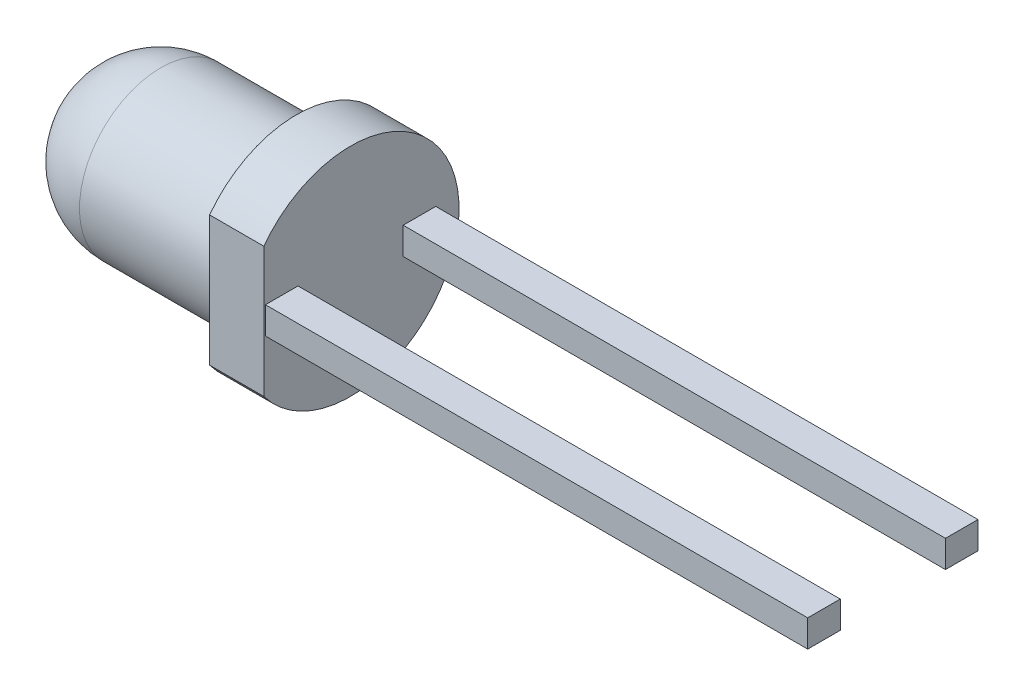
ISO-10303-21;
HEADER;
FILE_DESCRIPTION(('STEP AP214'),'2;1');
FILE_NAME('part.step','',(''),(''),'','','');
FILE_SCHEMA(('AUTOMOTIVE_DESIGN { 1 0 10303 214 1 1 1 1 }'));
ENDSEC;
DATA;
#1=APPLICATION_CONTEXT('core data for automotive mechanical design processes');
#2=APPLICATION_PROTOCOL_DEFINITION('international standard','automotive_design',2000,#1);
#3=PRODUCT_CONTEXT('',#1,'mechanical');
#4=PRODUCT('Part','Part','',(#3));
#5=PRODUCT_RELATED_PRODUCT_CATEGORY('part','',(#4));
#6=PRODUCT_DEFINITION_FORMATION('','',#4);
#7=PRODUCT_DEFINITION_CONTEXT('part definition',#1,'design');
#8=PRODUCT_DEFINITION('design','',#6,#7);
#9=PRODUCT_DEFINITION_SHAPE('','',#8);
#10=(LENGTH_UNIT() NAMED_UNIT(*) SI_UNIT(.MILLI.,.METRE.));
#11=(NAMED_UNIT(*) PLANE_ANGLE_UNIT() SI_UNIT($,.RADIAN.));
#12=(NAMED_UNIT(*) SI_UNIT($,.STERADIAN.) SOLID_ANGLE_UNIT());
#13=UNCERTAINTY_MEASURE_WITH_UNIT(LENGTH_MEASURE(1.E-05),#10,'distance_accuracy_value','');
#14=(GEOMETRIC_REPRESENTATION_CONTEXT(3) GLOBAL_UNCERTAINTY_ASSIGNED_CONTEXT((#13)) GLOBAL_UNIT_ASSIGNED_CONTEXT((#10,
#11,#12)) REPRESENTATION_CONTEXT('',''));
#15=CARTESIAN_POINT('',(0.,0.,0.));
#16=DIRECTION('',(0.,0.,1.));
#17=DIRECTION('',(1.,0.,0.));
#18=AXIS2_PLACEMENT_3D('',#15,#16,#17);
#19=CARTESIAN_POINT('',(10.,0.250000000000001,-1.57));
#20=DIRECTION('',(0.,0.,1.));
#21=DIRECTION('',(1.,0.,0.));
#22=AXIS2_PLACEMENT_3D('',#19,#20,#21);
#23=PLANE('',#22);
#24=DIRECTION('',(0.,1.,0.));
#25=VECTOR('',#24,1.);
#26=CARTESIAN_POINT('',(0.,0.250000000000001,-1.57));
#27=LINE('',#26,#25);
#28=CARTESIAN_POINT('',(0.,-0.249999999999999,-1.57));
#29=VERTEX_POINT('',#28);
#30=CARTESIAN_POINT('',(0.,0.250000000000001,-1.57));
#31=VERTEX_POINT('',#30);
#32=EDGE_CURVE('E109',#29,#31,#27,.T.);
#33=ORIENTED_EDGE('',*,*,#32,.T.);
#34=DIRECTION('',(-1.,0.,0.));
#35=VECTOR('',#34,1.);
#36=CARTESIAN_POINT('',(10.,0.250000000000001,-1.57));
#37=LINE('',#36,#35);
#38=CARTESIAN_POINT('',(10.,0.250000000000001,-1.57));
#39=VERTEX_POINT('',#38);
#40=EDGE_CURVE('E12',#39,#31,#37,.T.);
#41=ORIENTED_EDGE('',*,*,#40,.F.);
#42=DIRECTION('',(0.,1.,0.));
#43=VECTOR('',#42,1.);
#44=CARTESIAN_POINT('',(10.,0.250000000000001,-1.57));
#45=LINE('',#44,#43);
#46=CARTESIAN_POINT('',(10.,-0.249999999999999,-1.57));
#47=VERTEX_POINT('',#46);
#48=EDGE_CURVE('E97',#47,#39,#45,.T.);
#49=ORIENTED_EDGE('',*,*,#48,.F.);
#50=DIRECTION('',(-1.,0.,0.));
#51=VECTOR('',#50,1.);
#52=CARTESIAN_POINT('',(10.,-0.249999999999999,-1.57));
#53=LINE('',#52,#51);
#54=EDGE_CURVE('E105',#47,#29,#53,.T.);
#55=ORIENTED_EDGE('',*,*,#54,.T.);
#56=EDGE_LOOP('',(#33,#41,#49,#55));
#57=FACE_BOUND('',#56,.T.);
#58=ADVANCED_FACE('F46',(#57),#23,.F.);
#59=CARTESIAN_POINT('',(10.,0.250000000000001,-0.97));
#60=DIRECTION('',(0.,-1.,0.));
#61=DIRECTION('',(0.,0.,-1.));
#62=AXIS2_PLACEMENT_3D('',#59,#60,#61);
#63=PLANE('',#62);
#64=DIRECTION('',(0.,0.,1.));
#65=VECTOR('',#64,1.);
#66=CARTESIAN_POINT('',(0.,0.250000000000001,-0.97));
#67=LINE('',#66,#65);
#68=CARTESIAN_POINT('',(0.,0.250000000000001,-0.97));
#69=VERTEX_POINT('',#68);
#70=EDGE_CURVE('E101',#31,#69,#67,.T.);
#71=ORIENTED_EDGE('',*,*,#70,.T.);
#72=DIRECTION('',(-1.,0.,0.));
#73=VECTOR('',#72,1.);
#74=CARTESIAN_POINT('',(10.,0.250000000000001,-0.97));
#75=LINE('',#74,#73);
#76=CARTESIAN_POINT('',(10.,0.250000000000001,-0.97));
#77=VERTEX_POINT('',#76);
#78=EDGE_CURVE('E54',#77,#69,#75,.T.);
#79=ORIENTED_EDGE('',*,*,#78,.F.);
#80=DIRECTION('',(0.,0.,1.));
#81=VECTOR('',#80,1.);
#82=CARTESIAN_POINT('',(10.,0.250000000000001,-0.97));
#83=LINE('',#82,#81);
#84=EDGE_CURVE('E92',#39,#77,#83,.T.);
#85=ORIENTED_EDGE('',*,*,#84,.F.);
#86=ORIENTED_EDGE('',*,*,#40,.T.);
#87=EDGE_LOOP('',(#71,#79,#85,#86));
#88=FACE_BOUND('',#87,.T.);
#89=ADVANCED_FACE('F100',(#88),#63,.F.);
#90=CARTESIAN_POINT('',(10.,0.250000000000001,-0.97));
#91=DIRECTION('',(0.,0.,-1.));
#92=DIRECTION('',(0.,1.,0.));
#93=AXIS2_PLACEMENT_3D('',#90,#91,#92);
#94=PLANE('',#93);
#95=DIRECTION('',(0.,-1.,0.));
#96=VECTOR('',#95,1.);
#97=CARTESIAN_POINT('',(0.,0.250000000000001,-0.97));
#98=LINE('',#97,#96);
#99=CARTESIAN_POINT('',(0.,-0.249999999999999,-0.97));
#100=VERTEX_POINT('',#99);
#101=EDGE_CURVE('E79',#69,#100,#98,.T.);
#102=ORIENTED_EDGE('',*,*,#101,.T.);
#103=DIRECTION('',(-1.,0.,0.));
#104=VECTOR('',#103,1.);
#105=CARTESIAN_POINT('',(10.,-0.249999999999999,-0.97));
#106=LINE('',#105,#104);
#107=CARTESIAN_POINT('',(10.,-0.249999999999999,-0.97));
#108=VERTEX_POINT('',#107);
#109=EDGE_CURVE('E102',#108,#100,#106,.T.);
#110=ORIENTED_EDGE('',*,*,#109,.F.);
#111=DIRECTION('',(0.,-1.,0.));
#112=VECTOR('',#111,1.);
#113=CARTESIAN_POINT('',(10.,0.250000000000001,-0.97));
#114=LINE('',#113,#112);
#115=EDGE_CURVE('E95',#77,#108,#114,.T.);
#116=ORIENTED_EDGE('',*,*,#115,.F.);
#117=ORIENTED_EDGE('',*,*,#78,.T.);
#118=EDGE_LOOP('',(#102,#110,#116,#117));
#119=FACE_BOUND('',#118,.T.);
#120=ADVANCED_FACE('F103',(#119),#94,.F.);
#121=CARTESIAN_POINT('',(10.,-0.249999999999999,-0.97));
#122=DIRECTION('',(0.,1.,0.));
#123=DIRECTION('',(0.,0.,1.));
#124=AXIS2_PLACEMENT_3D('',#121,#122,#123);
#125=PLANE('',#124);
#126=DIRECTION('',(0.,0.,-1.));
#127=VECTOR('',#126,1.);
#128=CARTESIAN_POINT('',(0.,-0.249999999999999,-0.97));
#129=LINE('',#128,#127);
#130=EDGE_CURVE('E85',#100,#29,#129,.T.);
#131=ORIENTED_EDGE('',*,*,#130,.T.);
#132=ORIENTED_EDGE('',*,*,#54,.F.);
#133=DIRECTION('',(0.,0.,-1.));
#134=VECTOR('',#133,1.);
#135=CARTESIAN_POINT('',(10.,-0.249999999999999,-0.97));
#136=LINE('',#135,#134);
#137=EDGE_CURVE('E62',#108,#47,#136,.T.);
#138=ORIENTED_EDGE('',*,*,#137,.F.);
#139=ORIENTED_EDGE('',*,*,#109,.T.);
#140=EDGE_LOOP('',(#131,#132,#138,#139));
#141=FACE_BOUND('',#140,.T.);
#142=ADVANCED_FACE('F116',(#141),#125,.F.);
#143=CARTESIAN_POINT('',(10.,-0.249999999999999,-1.57));
#144=DIRECTION('',(1.,0.,0.));
#145=DIRECTION('',(0.,0.,-1.));
#146=AXIS2_PLACEMENT_3D('',#143,#144,#145);
#147=PLANE('',#146);
#148=ORIENTED_EDGE('',*,*,#48,.T.);
#149=ORIENTED_EDGE('',*,*,#84,.T.);
#150=ORIENTED_EDGE('',*,*,#115,.T.);
#151=ORIENTED_EDGE('',*,*,#137,.T.);
#152=EDGE_LOOP('',(#148,#149,#150,#151));
#153=FACE_BOUND('',#152,.T.);
#154=ADVANCED_FACE('F93',(#153),#147,.T.);
#155=CARTESIAN_POINT('',(0.,-0.249999999999999,-1.57));
#156=DIRECTION('',(1.,0.,0.));
#157=DIRECTION('',(0.,0.,-1.));
#158=AXIS2_PLACEMENT_3D('',#155,#156,#157);
#159=PLANE('',#158);
#160=ORIENTED_EDGE('',*,*,#32,.F.);
#161=ORIENTED_EDGE('',*,*,#130,.F.);
#162=ORIENTED_EDGE('',*,*,#101,.F.);
#163=ORIENTED_EDGE('',*,*,#70,.F.);
#164=EDGE_LOOP('',(#160,#161,#162,#163));
#165=FACE_BOUND('',#164,.T.);
#166=ADVANCED_FACE('F119',(#165),#159,.F.);
#167=CLOSED_SHELL('',(#58,#89,#120,#142,#154,#166));
#168=MANIFOLD_SOLID_BREP('B2',#167);
#169=CARTESIAN_POINT('',(10.,0.25,0.97));
#170=DIRECTION('',(0.,0.,1.));
#171=DIRECTION('',(0.,-1.,0.));
#172=AXIS2_PLACEMENT_3D('',#169,#170,#171);
#173=PLANE('',#172);
#174=DIRECTION('',(0.,1.,0.));
#175=VECTOR('',#174,1.);
#176=CARTESIAN_POINT('',(0.,0.25,0.97));
#177=LINE('',#176,#175);
#178=CARTESIAN_POINT('',(0.,-0.25,0.97));
#179=VERTEX_POINT('',#178);
#180=CARTESIAN_POINT('',(0.,0.25,0.97));
#181=VERTEX_POINT('',#180);
#182=EDGE_CURVE('E242',#179,#181,#177,.T.);
#183=ORIENTED_EDGE('',*,*,#182,.T.);
#184=DIRECTION('',(-1.,0.,0.));
#185=VECTOR('',#184,1.);
#186=CARTESIAN_POINT('',(10.,0.25,0.97));
#187=LINE('',#186,#185);
#188=CARTESIAN_POINT('',(10.,0.25,0.97));
#189=VERTEX_POINT('',#188);
#190=EDGE_CURVE('E44',#189,#181,#187,.T.);
#191=ORIENTED_EDGE('',*,*,#190,.F.);
#192=DIRECTION('',(0.,1.,0.));
#193=VECTOR('',#192,1.);
#194=CARTESIAN_POINT('',(10.,0.25,0.97));
#195=LINE('',#194,#193);
#196=CARTESIAN_POINT('',(10.,-0.25,0.97));
#197=VERTEX_POINT('',#196);
#198=EDGE_CURVE('E230',#197,#189,#195,.T.);
#199=ORIENTED_EDGE('',*,*,#198,.F.);
#200=DIRECTION('',(-1.,0.,0.));
#201=VECTOR('',#200,1.);
#202=CARTESIAN_POINT('',(10.,-0.25,0.97));
#203=LINE('',#202,#201);
#204=EDGE_CURVE('E238',#197,#179,#203,.T.);
#205=ORIENTED_EDGE('',*,*,#204,.T.);
#206=EDGE_LOOP('',(#183,#191,#199,#205));
#207=FACE_BOUND('',#206,.T.);
#208=ADVANCED_FACE('F179',(#207),#173,.F.);
#209=CARTESIAN_POINT('',(10.,0.25,1.57));
#210=DIRECTION('',(0.,-1.,0.));
#211=DIRECTION('',(0.,0.,-1.));
#212=AXIS2_PLACEMENT_3D('',#209,#210,#211);
#213=PLANE('',#212);
#214=DIRECTION('',(0.,0.,1.));
#215=VECTOR('',#214,1.);
#216=CARTESIAN_POINT('',(0.,0.25,1.57));
#217=LINE('',#216,#215);
#218=CARTESIAN_POINT('',(0.,0.25,1.57));
#219=VERTEX_POINT('',#218);
#220=EDGE_CURVE('E234',#181,#219,#217,.T.);
#221=ORIENTED_EDGE('',*,*,#220,.T.);
#222=DIRECTION('',(-1.,0.,0.));
#223=VECTOR('',#222,1.);
#224=CARTESIAN_POINT('',(10.,0.25,1.57));
#225=LINE('',#224,#223);
#226=CARTESIAN_POINT('',(10.,0.25,1.57));
#227=VERTEX_POINT('',#226);
#228=EDGE_CURVE('E187',#227,#219,#225,.T.);
#229=ORIENTED_EDGE('',*,*,#228,.F.);
#230=DIRECTION('',(0.,0.,1.));
#231=VECTOR('',#230,1.);
#232=CARTESIAN_POINT('',(10.,0.25,1.57));
#233=LINE('',#232,#231);
#234=EDGE_CURVE('E225',#189,#227,#233,.T.);
#235=ORIENTED_EDGE('',*,*,#234,.F.);
#236=ORIENTED_EDGE('',*,*,#190,.T.);
#237=EDGE_LOOP('',(#221,#229,#235,#236));
#238=FACE_BOUND('',#237,.T.);
#239=ADVANCED_FACE('F233',(#238),#213,.F.);
#240=CARTESIAN_POINT('',(10.,0.25,1.57));
#241=DIRECTION('',(0.,0.,-1.));
#242=DIRECTION('',(-1.,0.,0.));
#243=AXIS2_PLACEMENT_3D('',#240,#241,#242);
#244=PLANE('',#243);
#245=DIRECTION('',(0.,-1.,0.));
#246=VECTOR('',#245,1.);
#247=CARTESIAN_POINT('',(0.,0.25,1.57));
#248=LINE('',#247,#246);
#249=CARTESIAN_POINT('',(0.,-0.25,1.57));
#250=VERTEX_POINT('',#249);
#251=EDGE_CURVE('E212',#219,#250,#248,.T.);
#252=ORIENTED_EDGE('',*,*,#251,.T.);
#253=DIRECTION('',(-1.,0.,0.));
#254=VECTOR('',#253,1.);
#255=CARTESIAN_POINT('',(10.,-0.25,1.57));
#256=LINE('',#255,#254);
#257=CARTESIAN_POINT('',(10.,-0.25,1.57));
#258=VERTEX_POINT('',#257);
#259=EDGE_CURVE('E235',#258,#250,#256,.T.);
#260=ORIENTED_EDGE('',*,*,#259,.F.);
#261=DIRECTION('',(0.,-1.,0.));
#262=VECTOR('',#261,1.);
#263=CARTESIAN_POINT('',(10.,0.25,1.57));
#264=LINE('',#263,#262);
#265=EDGE_CURVE('E228',#227,#258,#264,.T.);
#266=ORIENTED_EDGE('',*,*,#265,.F.);
#267=ORIENTED_EDGE('',*,*,#228,.T.);
#268=EDGE_LOOP('',(#252,#260,#266,#267));
#269=FACE_BOUND('',#268,.T.);
#270=ADVANCED_FACE('F236',(#269),#244,.F.);
#271=CARTESIAN_POINT('',(10.,-0.25,1.57));
#272=DIRECTION('',(0.,1.,0.));
#273=DIRECTION('',(0.,0.,1.));
#274=AXIS2_PLACEMENT_3D('',#271,#272,#273);
#275=PLANE('',#274);
#276=DIRECTION('',(0.,0.,-1.));
#277=VECTOR('',#276,1.);
#278=CARTESIAN_POINT('',(0.,-0.25,1.57));
#279=LINE('',#278,#277);
#280=EDGE_CURVE('E218',#250,#179,#279,.T.);
#281=ORIENTED_EDGE('',*,*,#280,.T.);
#282=ORIENTED_EDGE('',*,*,#204,.F.);
#283=DIRECTION('',(0.,0.,-1.));
#284=VECTOR('',#283,1.);
#285=CARTESIAN_POINT('',(10.,-0.25,1.57));
#286=LINE('',#285,#284);
#287=EDGE_CURVE('E195',#258,#197,#286,.T.);
#288=ORIENTED_EDGE('',*,*,#287,.F.);
#289=ORIENTED_EDGE('',*,*,#259,.T.);
#290=EDGE_LOOP('',(#281,#282,#288,#289));
#291=FACE_BOUND('',#290,.T.);
#292=ADVANCED_FACE('F249',(#291),#275,.F.);
#293=CARTESIAN_POINT('',(10.,-0.25,0.97));
#294=DIRECTION('',(1.,0.,0.));
#295=DIRECTION('',(0.,0.,-1.));
#296=AXIS2_PLACEMENT_3D('',#293,#294,#295);
#297=PLANE('',#296);
#298=ORIENTED_EDGE('',*,*,#198,.T.);
#299=ORIENTED_EDGE('',*,*,#234,.T.);
#300=ORIENTED_EDGE('',*,*,#265,.T.);
#301=ORIENTED_EDGE('',*,*,#287,.T.);
#302=EDGE_LOOP('',(#298,#299,#300,#301));
#303=FACE_BOUND('',#302,.T.);
#304=ADVANCED_FACE('F226',(#303),#297,.T.);
#305=CARTESIAN_POINT('',(0.,-0.25,0.97));
#306=DIRECTION('',(1.,0.,0.));
#307=DIRECTION('',(0.,0.,-1.));
#308=AXIS2_PLACEMENT_3D('',#305,#306,#307);
#309=PLANE('',#308);
#310=ORIENTED_EDGE('',*,*,#182,.F.);
#311=ORIENTED_EDGE('',*,*,#280,.F.);
#312=ORIENTED_EDGE('',*,*,#251,.F.);
#313=ORIENTED_EDGE('',*,*,#220,.F.);
#314=EDGE_LOOP('',(#310,#311,#312,#313));
#315=FACE_BOUND('',#314,.T.);
#316=ADVANCED_FACE('F252',(#315),#309,.F.);
#317=CLOSED_SHELL('',(#208,#239,#270,#292,#304,#316));
#318=MANIFOLD_SOLID_BREP('B6',#317);
#319=CARTESIAN_POINT('',(0.,0.,0.));
#320=DIRECTION('',(1.,0.,0.));
#321=DIRECTION('',(0.,0.,-1.));
#322=AXIS2_PLACEMENT_3D('',#319,#320,#321);
#323=PLANE('',#322);
#324=DIRECTION('',(0.,1.,0.));
#325=VECTOR('',#324,1.);
#326=CARTESIAN_POINT('',(0.,0.,1.6));
#327=LINE('',#326,#325);
#328=CARTESIAN_POINT('',(0.,-1.2,1.6));
#329=VERTEX_POINT('',#328);
#330=CARTESIAN_POINT('',(0.,1.2,1.6));
#331=VERTEX_POINT('',#330);
#332=EDGE_CURVE('E322',#329,#331,#327,.T.);
#333=ORIENTED_EDGE('',*,*,#332,.F.);
#334=CARTESIAN_POINT('',(0.,0.,0.));
#335=DIRECTION('',(1.,0.,0.));
#336=DIRECTION('',(0.,0.,-1.));
#337=AXIS2_PLACEMENT_3D('',#334,#335,#336);
#338=CIRCLE('',#337,2.);
#339=EDGE_CURVE('E177',#329,#331,#338,.T.);
#340=ORIENTED_EDGE('',*,*,#339,.T.);
#341=EDGE_LOOP('',(#333,#340));
#342=FACE_BOUND('',#341,.T.);
#343=ADVANCED_FACE('F303',(#342),#323,.T.);
#344=CARTESIAN_POINT('',(0.,0.,0.));
#345=DIRECTION('',(1.,0.,0.));
#346=DIRECTION('',(0.,0.,-1.));
#347=AXIS2_PLACEMENT_3D('',#344,#345,#346);
#348=CYLINDRICAL_SURFACE('',#347,2.);
#349=DIRECTION('',(-1.,0.,0.));
#350=VECTOR('',#349,1.);
#351=CARTESIAN_POINT('',(10.,1.2,1.6));
#352=LINE('',#351,#350);
#353=CARTESIAN_POINT('',(-1.,1.2,1.6));
#354=VERTEX_POINT('',#353);
#355=EDGE_CURVE('E317',#331,#354,#352,.T.);
#356=ORIENTED_EDGE('',*,*,#355,.F.);
#357=ORIENTED_EDGE('',*,*,#339,.F.);
#358=DIRECTION('',(-1.,0.,0.));
#359=VECTOR('',#358,1.);
#360=CARTESIAN_POINT('',(10.,-1.2,1.6));
#361=LINE('',#360,#359);
#362=CARTESIAN_POINT('',(-1.,-1.2,1.6));
#363=VERTEX_POINT('',#362);
#364=EDGE_CURVE('E329',#329,#363,#361,.T.);
#365=ORIENTED_EDGE('',*,*,#364,.T.);
#366=CARTESIAN_POINT('',(-1.,0.,0.));
#367=DIRECTION('',(1.,0.,0.));
#368=DIRECTION('',(0.,0.,-1.));
#369=AXIS2_PLACEMENT_3D('',#366,#367,#368);
#370=CIRCLE('',#369,2.);
#371=EDGE_CURVE('E310',#363,#354,#370,.T.);
#372=ORIENTED_EDGE('',*,*,#371,.T.);
#373=EDGE_LOOP('',(#356,#357,#365,#372));
#374=FACE_BOUND('',#373,.T.);
#375=ADVANCED_FACE('F336',(#374),#348,.T.);
#376=CARTESIAN_POINT('',(-1.,2.,0.));
#377=DIRECTION('',(-1.,0.,0.));
#378=DIRECTION('',(0.,0.,1.));
#379=AXIS2_PLACEMENT_3D('',#376,#377,#378);
#380=PLANE('',#379);
#381=DIRECTION('',(0.,-1.,0.));
#382=VECTOR('',#381,1.);
#383=CARTESIAN_POINT('',(-1.,1.2,1.6));
#384=LINE('',#383,#382);
#385=EDGE_CURVE('E326',#354,#363,#384,.T.);
#386=ORIENTED_EDGE('',*,*,#385,.F.);
#387=ORIENTED_EDGE('',*,*,#371,.F.);
#388=EDGE_LOOP('',(#386,#387));
#389=FACE_BOUND('',#388,.T.);
#390=CARTESIAN_POINT('',(-1.,0.,0.));
#391=DIRECTION('',(1.,0.,0.));
#392=DIRECTION('',(0.,0.,-1.));
#393=AXIS2_PLACEMENT_3D('',#390,#391,#392);
#394=CIRCLE('',#393,1.5);
#395=CARTESIAN_POINT('',(-1.,0.,-1.5));
#396=VERTEX_POINT('',#395);
#397=EDGE_CURVE('E340',#396,#396,#394,.T.);
#398=ORIENTED_EDGE('',*,*,#397,.T.);
#399=EDGE_LOOP('',(#398));
#400=FACE_BOUND('',#399,.T.);
#401=ADVANCED_FACE('F338',(#389,#400),#380,.T.);
#402=CARTESIAN_POINT('',(0.,0.,0.));
#403=DIRECTION('',(1.,0.,0.));
#404=DIRECTION('',(0.,0.,-1.));
#405=AXIS2_PLACEMENT_3D('',#402,#403,#404);
#406=CYLINDRICAL_SURFACE('',#405,1.5);
#407=CARTESIAN_POINT('',(-3.50000000000001,0.,0.));
#408=DIRECTION('',(1.,0.,0.));
#409=DIRECTION('',(0.,0.,-1.));
#410=AXIS2_PLACEMENT_3D('',#407,#408,#409);
#411=CIRCLE('',#410,1.5);
#412=CARTESIAN_POINT('',(-3.50000000000001,0.,-1.5));
#413=VERTEX_POINT('',#412);
#414=EDGE_CURVE('E342',#413,#413,#411,.T.);
#415=ORIENTED_EDGE('',*,*,#414,.T.);
#416=EDGE_LOOP('',(#415));
#417=FACE_BOUND('',#416,.T.);
#418=ORIENTED_EDGE('',*,*,#397,.F.);
#419=EDGE_LOOP('',(#418));
#420=FACE_BOUND('',#419,.T.);
#421=ADVANCED_FACE('F350',(#417,#420),#406,.T.);
#422=CARTESIAN_POINT('',(-3.50000000000001,0.,0.));
#423=DIRECTION('',(1.,0.,0.));
#424=DIRECTION('',(0.,1.,0.));
#425=AXIS2_PLACEMENT_3D('',#422,#423,#424);
#426=SPHERICAL_SURFACE('',#425,1.5);
#427=ORIENTED_EDGE('',*,*,#414,.F.);
#428=EDGE_LOOP('',(#427));
#429=FACE_BOUND('',#428,.T.);
#430=ADVANCED_FACE('F353',(#429),#426,.T.);
#431=CARTESIAN_POINT('',(10.,1.2,1.6));
#432=DIRECTION('',(0.,0.,-1.));
#433=DIRECTION('',(-1.,0.,0.));
#434=AXIS2_PLACEMENT_3D('',#431,#432,#433);
#435=PLANE('',#434);
#436=ORIENTED_EDGE('',*,*,#332,.T.);
#437=ORIENTED_EDGE('',*,*,#355,.T.);
#438=ORIENTED_EDGE('',*,*,#385,.T.);
#439=ORIENTED_EDGE('',*,*,#364,.F.);
#440=EDGE_LOOP('',(#436,#437,#438,#439));
#441=FACE_BOUND('',#440,.T.);
#442=ADVANCED_FACE('F328',(#441),#435,.F.);
#443=CLOSED_SHELL('',(#343,#375,#401,#421,#430,#442));
#444=MANIFOLD_SOLID_BREP('B38',#443);
#445=ADVANCED_BREP_SHAPE_REPRESENTATION('',(#18,#168,#318,#444),#14);
#446=SHAPE_DEFINITION_REPRESENTATION(#9,#445);
ENDSEC;
END-ISO-10303-21;
